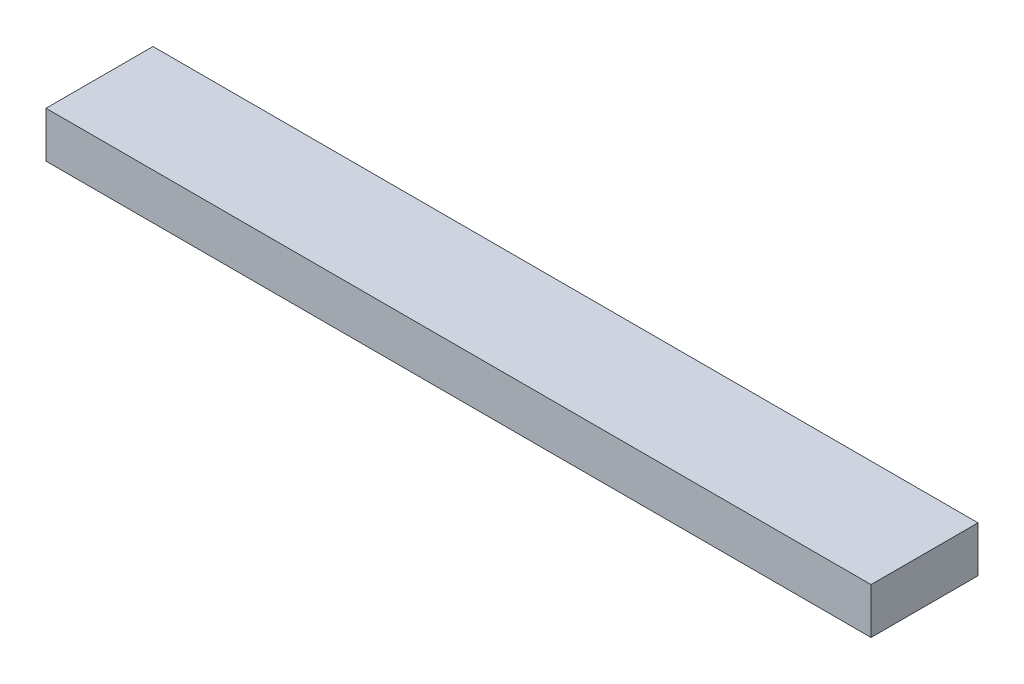
ISO-10303-21;
HEADER;
FILE_DESCRIPTION(('STEP AP214'),'2;1');
FILE_NAME('part.step','',(''),(''),'','','');
FILE_SCHEMA(('AUTOMOTIVE_DESIGN { 1 0 10303 214 1 1 1 1 }'));
ENDSEC;
DATA;
#1=APPLICATION_CONTEXT('core data for automotive mechanical design processes');
#2=APPLICATION_PROTOCOL_DEFINITION('international standard','automotive_design',2000,#1);
#3=PRODUCT_CONTEXT('',#1,'mechanical');
#4=PRODUCT('Part','Part','',(#3));
#5=PRODUCT_RELATED_PRODUCT_CATEGORY('part','',(#4));
#6=PRODUCT_DEFINITION_FORMATION('','',#4);
#7=PRODUCT_DEFINITION_CONTEXT('part definition',#1,'design');
#8=PRODUCT_DEFINITION('design','',#6,#7);
#9=PRODUCT_DEFINITION_SHAPE('','',#8);
#10=(LENGTH_UNIT() NAMED_UNIT(*) SI_UNIT(.MILLI.,.METRE.));
#11=(NAMED_UNIT(*) PLANE_ANGLE_UNIT() SI_UNIT($,.RADIAN.));
#12=(NAMED_UNIT(*) SI_UNIT($,.STERADIAN.) SOLID_ANGLE_UNIT());
#13=UNCERTAINTY_MEASURE_WITH_UNIT(LENGTH_MEASURE(1.E-05),#10,'distance_accuracy_value','');
#14=(GEOMETRIC_REPRESENTATION_CONTEXT(3) GLOBAL_UNCERTAINTY_ASSIGNED_CONTEXT((#13)) GLOBAL_UNIT_ASSIGNED_CONTEXT((#10,
#11,#12)) REPRESENTATION_CONTEXT('',''));
#15=CARTESIAN_POINT('',(0.,0.,0.));
#16=DIRECTION('',(0.,0.,1.));
#17=DIRECTION('',(1.,0.,0.));
#18=AXIS2_PLACEMENT_3D('',#15,#16,#17);
#19=CARTESIAN_POINT('',(0.,38.1,0.));
#20=DIRECTION('',(1.,0.,0.));
#21=DIRECTION('',(0.,0.,-1.));
#22=AXIS2_PLACEMENT_3D('',#19,#20,#21);
#23=PLANE('',#22);
#24=DIRECTION('',(0.,0.,1.));
#25=VECTOR('',#24,1.);
#26=CARTESIAN_POINT('',(0.,0.,0.));
#27=LINE('',#26,#25);
#28=CARTESIAN_POINT('',(0.,0.,-88.9));
#29=VERTEX_POINT('',#28);
#30=CARTESIAN_POINT('',(0.,0.,0.));
#31=VERTEX_POINT('',#30);
#32=EDGE_CURVE('E110',#29,#31,#27,.T.);
#33=ORIENTED_EDGE('',*,*,#32,.T.);
#34=DIRECTION('',(0.,-1.,0.));
#35=VECTOR('',#34,1.);
#36=CARTESIAN_POINT('',(0.,38.1,0.));
#37=LINE('',#36,#35);
#38=CARTESIAN_POINT('',(0.,38.1,0.));
#39=VERTEX_POINT('',#38);
#40=EDGE_CURVE('E11',#39,#31,#37,.T.);
#41=ORIENTED_EDGE('',*,*,#40,.F.);
#42=DIRECTION('',(0.,0.,1.));
#43=VECTOR('',#42,1.);
#44=CARTESIAN_POINT('',(0.,38.1,0.));
#45=LINE('',#44,#43);
#46=CARTESIAN_POINT('',(0.,38.1,-88.9));
#47=VERTEX_POINT('',#46);
#48=EDGE_CURVE('E93',#47,#39,#45,.T.);
#49=ORIENTED_EDGE('',*,*,#48,.F.);
#50=DIRECTION('',(0.,-1.,0.));
#51=VECTOR('',#50,1.);
#52=CARTESIAN_POINT('',(0.,38.1,-88.9));
#53=LINE('',#52,#51);
#54=EDGE_CURVE('E106',#47,#29,#53,.T.);
#55=ORIENTED_EDGE('',*,*,#54,.T.);
#56=EDGE_LOOP('',(#33,#41,#49,#55));
#57=FACE_BOUND('',#56,.T.);
#58=ADVANCED_FACE('F41',(#57),#23,.F.);
#59=CARTESIAN_POINT('',(0.,38.1,0.));
#60=DIRECTION('',(0.,0.,-1.));
#61=DIRECTION('',(-1.,0.,0.));
#62=AXIS2_PLACEMENT_3D('',#59,#60,#61);
#63=PLANE('',#62);
#64=DIRECTION('',(1.,0.,0.));
#65=VECTOR('',#64,1.);
#66=CARTESIAN_POINT('',(0.,0.,0.));
#67=LINE('',#66,#65);
#68=CARTESIAN_POINT('',(685.8,0.,0.));
#69=VERTEX_POINT('',#68);
#70=EDGE_CURVE('E98',#31,#69,#67,.T.);
#71=ORIENTED_EDGE('',*,*,#70,.T.);
#72=DIRECTION('',(0.,-1.,0.));
#73=VECTOR('',#72,1.);
#74=CARTESIAN_POINT('',(685.8,38.1,0.));
#75=LINE('',#74,#73);
#76=CARTESIAN_POINT('',(685.8,38.1,0.));
#77=VERTEX_POINT('',#76);
#78=EDGE_CURVE('E50',#77,#69,#75,.T.);
#79=ORIENTED_EDGE('',*,*,#78,.F.);
#80=DIRECTION('',(1.,0.,0.));
#81=VECTOR('',#80,1.);
#82=CARTESIAN_POINT('',(0.,38.1,0.));
#83=LINE('',#82,#81);
#84=EDGE_CURVE('E88',#39,#77,#83,.T.);
#85=ORIENTED_EDGE('',*,*,#84,.F.);
#86=ORIENTED_EDGE('',*,*,#40,.T.);
#87=EDGE_LOOP('',(#71,#79,#85,#86));
#88=FACE_BOUND('',#87,.T.);
#89=ADVANCED_FACE('F97',(#88),#63,.F.);
#90=CARTESIAN_POINT('',(685.8,38.1,0.));
#91=DIRECTION('',(-1.,0.,0.));
#92=DIRECTION('',(0.,0.,1.));
#93=AXIS2_PLACEMENT_3D('',#90,#91,#92);
#94=PLANE('',#93);
#95=DIRECTION('',(0.,0.,-1.));
#96=VECTOR('',#95,1.);
#97=CARTESIAN_POINT('',(685.8,0.,0.));
#98=LINE('',#97,#96);
#99=CARTESIAN_POINT('',(685.8,0.,-88.9));
#100=VERTEX_POINT('',#99);
#101=EDGE_CURVE('E75',#69,#100,#98,.T.);
#102=ORIENTED_EDGE('',*,*,#101,.T.);
#103=DIRECTION('',(0.,-1.,0.));
#104=VECTOR('',#103,1.);
#105=CARTESIAN_POINT('',(685.8,38.1,-88.9));
#106=LINE('',#105,#104);
#107=CARTESIAN_POINT('',(685.8,38.1,-88.9));
#108=VERTEX_POINT('',#107);
#109=EDGE_CURVE('E100',#108,#100,#106,.T.);
#110=ORIENTED_EDGE('',*,*,#109,.F.);
#111=DIRECTION('',(0.,0.,-1.));
#112=VECTOR('',#111,1.);
#113=CARTESIAN_POINT('',(685.8,38.1,0.));
#114=LINE('',#113,#112);
#115=EDGE_CURVE('E91',#77,#108,#114,.T.);
#116=ORIENTED_EDGE('',*,*,#115,.F.);
#117=ORIENTED_EDGE('',*,*,#78,.T.);
#118=EDGE_LOOP('',(#102,#110,#116,#117));
#119=FACE_BOUND('',#118,.T.);
#120=ADVANCED_FACE('F101',(#119),#94,.F.);
#121=CARTESIAN_POINT('',(0.,38.1,-88.9));
#122=DIRECTION('',(0.,0.,1.));
#123=DIRECTION('',(1.,0.,0.));
#124=AXIS2_PLACEMENT_3D('',#121,#122,#123);
#125=PLANE('',#124);
#126=DIRECTION('',(-1.,0.,0.));
#127=VECTOR('',#126,1.);
#128=CARTESIAN_POINT('',(0.,0.,-88.9));
#129=LINE('',#128,#127);
#130=EDGE_CURVE('E81',#100,#29,#129,.T.);
#131=ORIENTED_EDGE('',*,*,#130,.T.);
#132=ORIENTED_EDGE('',*,*,#54,.F.);
#133=DIRECTION('',(-1.,0.,0.));
#134=VECTOR('',#133,1.);
#135=CARTESIAN_POINT('',(0.,38.1,-88.9));
#136=LINE('',#135,#134);
#137=EDGE_CURVE('E58',#108,#47,#136,.T.);
#138=ORIENTED_EDGE('',*,*,#137,.F.);
#139=ORIENTED_EDGE('',*,*,#109,.T.);
#140=EDGE_LOOP('',(#131,#132,#138,#139));
#141=FACE_BOUND('',#140,.T.);
#142=ADVANCED_FACE('F124',(#141),#125,.F.);
#143=CARTESIAN_POINT('',(0.,38.1,0.));
#144=DIRECTION('',(0.,-1.,0.));
#145=DIRECTION('',(0.,0.,-1.));
#146=AXIS2_PLACEMENT_3D('',#143,#144,#145);
#147=PLANE('',#146);
#148=ORIENTED_EDGE('',*,*,#48,.T.);
#149=ORIENTED_EDGE('',*,*,#84,.T.);
#150=ORIENTED_EDGE('',*,*,#115,.T.);
#151=ORIENTED_EDGE('',*,*,#137,.T.);
#152=EDGE_LOOP('',(#148,#149,#150,#151));
#153=FACE_BOUND('',#152,.T.);
#154=ADVANCED_FACE('F89',(#153),#147,.F.);
#155=CARTESIAN_POINT('',(0.,0.,0.));
#156=DIRECTION('',(0.,-1.,0.));
#157=DIRECTION('',(0.,0.,-1.));
#158=AXIS2_PLACEMENT_3D('',#155,#156,#157);
#159=PLANE('',#158);
#160=ORIENTED_EDGE('',*,*,#32,.F.);
#161=ORIENTED_EDGE('',*,*,#130,.F.);
#162=ORIENTED_EDGE('',*,*,#101,.F.);
#163=ORIENTED_EDGE('',*,*,#70,.F.);
#164=EDGE_LOOP('',(#160,#161,#162,#163));
#165=FACE_BOUND('',#164,.T.);
#166=ADVANCED_FACE('F127',(#165),#159,.T.);
#167=CLOSED_SHELL('',(#58,#89,#120,#142,#154,#166));
#168=MANIFOLD_SOLID_BREP('B2',#167);
#169=ADVANCED_BREP_SHAPE_REPRESENTATION('',(#18,#168),#14);
#170=SHAPE_DEFINITION_REPRESENTATION(#9,#169);
ENDSEC;
END-ISO-10303-21;
